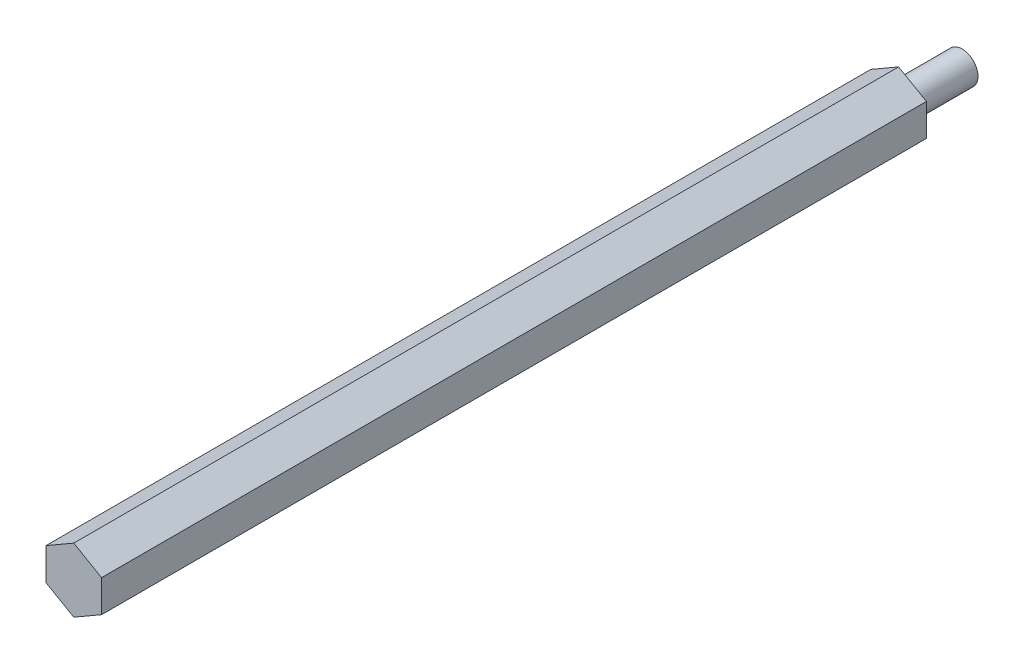
ISO-10303-21;
HEADER;
FILE_DESCRIPTION(('STEP AP214'),'2;1');
FILE_NAME('part.step','',(''),(''),'','','');
FILE_SCHEMA(('AUTOMOTIVE_DESIGN { 1 0 10303 214 1 1 1 1 }'));
ENDSEC;
DATA;
#1=APPLICATION_CONTEXT('core data for automotive mechanical design processes');
#2=APPLICATION_PROTOCOL_DEFINITION('international standard','automotive_design',2000,#1);
#3=PRODUCT_CONTEXT('',#1,'mechanical');
#4=PRODUCT('Part','Part','',(#3));
#5=PRODUCT_RELATED_PRODUCT_CATEGORY('part','',(#4));
#6=PRODUCT_DEFINITION_FORMATION('','',#4);
#7=PRODUCT_DEFINITION_CONTEXT('part definition',#1,'design');
#8=PRODUCT_DEFINITION('design','',#6,#7);
#9=PRODUCT_DEFINITION_SHAPE('','',#8);
#10=(LENGTH_UNIT() NAMED_UNIT(*) SI_UNIT(.MILLI.,.METRE.));
#11=(NAMED_UNIT(*) PLANE_ANGLE_UNIT() SI_UNIT($,.RADIAN.));
#12=(NAMED_UNIT(*) SI_UNIT($,.STERADIAN.) SOLID_ANGLE_UNIT());
#13=UNCERTAINTY_MEASURE_WITH_UNIT(LENGTH_MEASURE(1.E-05),#10,'distance_accuracy_value','');
#14=(GEOMETRIC_REPRESENTATION_CONTEXT(3) GLOBAL_UNCERTAINTY_ASSIGNED_CONTEXT((#13)) GLOBAL_UNIT_ASSIGNED_CONTEXT((#10,
#11,#12)) REPRESENTATION_CONTEXT('',''));
#15=CARTESIAN_POINT('',(0.,0.,0.));
#16=DIRECTION('',(0.,0.,1.));
#17=DIRECTION('',(1.,0.,0.));
#18=AXIS2_PLACEMENT_3D('',#15,#16,#17);
#19=CARTESIAN_POINT('',(-5.55625,3.20790243318486,82.5));
#20=DIRECTION('',(1.,0.,0.));
#21=DIRECTION('',(0.,1.,0.));
#22=AXIS2_PLACEMENT_3D('',#19,#20,#21);
#23=PLANE('',#22);
#24=DIRECTION('',(0.,0.,-1.));
#25=VECTOR('',#24,1.);
#26=CARTESIAN_POINT('',(-5.55625,3.20790243318486,82.5));
#27=LINE('',#26,#25);
#28=CARTESIAN_POINT('',(-5.55625,3.20790243318486,82.5));
#29=VERTEX_POINT('',#28);
#30=CARTESIAN_POINT('',(-5.55625,3.20790243318486,-82.5));
#31=VERTEX_POINT('',#30);
#32=EDGE_CURVE('E117',#29,#31,#27,.T.);
#33=ORIENTED_EDGE('',*,*,#32,.T.);
#34=DIRECTION('',(0.,-1.,0.));
#35=VECTOR('',#34,1.);
#36=CARTESIAN_POINT('',(-5.55625,3.20790243318486,-82.5));
#37=LINE('',#36,#35);
#38=CARTESIAN_POINT('',(-5.55625,-3.20790243318486,-82.5));
#39=VERTEX_POINT('',#38);
#40=EDGE_CURVE('E110',#31,#39,#37,.T.);
#41=ORIENTED_EDGE('',*,*,#40,.T.);
#42=DIRECTION('',(0.,0.,-1.));
#43=VECTOR('',#42,1.);
#44=CARTESIAN_POINT('',(-5.55625,-3.20790243318486,82.5));
#45=LINE('',#44,#43);
#46=CARTESIAN_POINT('',(-5.55625,-3.20790243318486,82.5));
#47=VERTEX_POINT('',#46);
#48=EDGE_CURVE('E11',#47,#39,#45,.T.);
#49=ORIENTED_EDGE('',*,*,#48,.F.);
#50=DIRECTION('',(0.,-1.,0.));
#51=VECTOR('',#50,1.);
#52=CARTESIAN_POINT('',(-5.55625,3.20790243318486,82.5));
#53=LINE('',#52,#51);
#54=EDGE_CURVE('E140',#29,#47,#53,.T.);
#55=ORIENTED_EDGE('',*,*,#54,.F.);
#56=EDGE_LOOP('',(#33,#41,#49,#55));
#57=FACE_BOUND('',#56,.T.);
#58=ADVANCED_FACE('F45',(#57),#23,.F.);
#59=CARTESIAN_POINT('',(-5.55625,-3.20790243318486,82.5));
#60=DIRECTION('',(0.5,0.866025403784439,0.));
#61=DIRECTION('',(-0.866025403784439,0.5,0.));
#62=AXIS2_PLACEMENT_3D('',#59,#60,#61);
#63=PLANE('',#62);
#64=ORIENTED_EDGE('',*,*,#48,.T.);
#65=DIRECTION('',(0.866025403784439,-0.5,0.));
#66=VECTOR('',#65,1.);
#67=CARTESIAN_POINT('',(-5.55625,-3.20790243318486,-82.5));
#68=LINE('',#67,#66);
#69=CARTESIAN_POINT('',(0.,-6.41580486636971,-82.5));
#70=VERTEX_POINT('',#69);
#71=EDGE_CURVE('E100',#39,#70,#68,.T.);
#72=ORIENTED_EDGE('',*,*,#71,.T.);
#73=DIRECTION('',(0.,0.,-1.));
#74=VECTOR('',#73,1.);
#75=CARTESIAN_POINT('',(0.,-6.41580486636971,82.5));
#76=LINE('',#75,#74);
#77=CARTESIAN_POINT('',(0.,-6.41580486636971,82.5));
#78=VERTEX_POINT('',#77);
#79=EDGE_CURVE('E53',#78,#70,#76,.T.);
#80=ORIENTED_EDGE('',*,*,#79,.F.);
#81=DIRECTION('',(0.866025403784439,-0.5,0.));
#82=VECTOR('',#81,1.);
#83=CARTESIAN_POINT('',(-5.55625,-3.20790243318486,82.5));
#84=LINE('',#83,#82);
#85=EDGE_CURVE('E101',#47,#78,#84,.T.);
#86=ORIENTED_EDGE('',*,*,#85,.F.);
#87=EDGE_LOOP('',(#64,#72,#80,#86));
#88=FACE_BOUND('',#87,.T.);
#89=ADVANCED_FACE('F98',(#88),#63,.F.);
#90=CARTESIAN_POINT('',(0.,-6.41580486636971,82.5));
#91=DIRECTION('',(-0.5,0.866025403784439,0.));
#92=DIRECTION('',(-0.866025403784439,-0.5,0.));
#93=AXIS2_PLACEMENT_3D('',#90,#91,#92);
#94=PLANE('',#93);
#95=ORIENTED_EDGE('',*,*,#79,.T.);
#96=DIRECTION('',(0.866025403784439,0.5,0.));
#97=VECTOR('',#96,1.);
#98=CARTESIAN_POINT('',(0.,-6.41580486636971,-82.5));
#99=LINE('',#98,#97);
#100=CARTESIAN_POINT('',(5.55625,-3.20790243318486,-82.5));
#101=VERTEX_POINT('',#100);
#102=EDGE_CURVE('E114',#70,#101,#99,.T.);
#103=ORIENTED_EDGE('',*,*,#102,.T.);
#104=DIRECTION('',(0.,0.,-1.));
#105=VECTOR('',#104,1.);
#106=CARTESIAN_POINT('',(5.55625,-3.20790243318486,82.5));
#107=LINE('',#106,#105);
#108=CARTESIAN_POINT('',(5.55625,-3.20790243318486,82.5));
#109=VERTEX_POINT('',#108);
#110=EDGE_CURVE('E163',#109,#101,#107,.T.);
#111=ORIENTED_EDGE('',*,*,#110,.F.);
#112=DIRECTION('',(0.866025403784439,0.5,0.));
#113=VECTOR('',#112,1.);
#114=CARTESIAN_POINT('',(0.,-6.41580486636971,82.5));
#115=LINE('',#114,#113);
#116=EDGE_CURVE('E145',#78,#109,#115,.T.);
#117=ORIENTED_EDGE('',*,*,#116,.F.);
#118=EDGE_LOOP('',(#95,#103,#111,#117));
#119=FACE_BOUND('',#118,.T.);
#120=ADVANCED_FACE('F168',(#119),#94,.F.);
#121=CARTESIAN_POINT('',(5.55625,-3.20790243318486,82.5));
#122=DIRECTION('',(-1.,0.,0.));
#123=DIRECTION('',(0.,0.,1.));
#124=AXIS2_PLACEMENT_3D('',#121,#122,#123);
#125=PLANE('',#124);
#126=ORIENTED_EDGE('',*,*,#110,.T.);
#127=DIRECTION('',(0.,1.,0.));
#128=VECTOR('',#127,1.);
#129=CARTESIAN_POINT('',(5.55625,-3.20790243318486,-82.5));
#130=LINE('',#129,#128);
#131=CARTESIAN_POINT('',(5.55625,3.20790243318486,-82.5));
#132=VERTEX_POINT('',#131);
#133=EDGE_CURVE('E129',#101,#132,#130,.T.);
#134=ORIENTED_EDGE('',*,*,#133,.T.);
#135=DIRECTION('',(0.,0.,-1.));
#136=VECTOR('',#135,1.);
#137=CARTESIAN_POINT('',(5.55625,3.20790243318486,82.5));
#138=LINE('',#137,#136);
#139=CARTESIAN_POINT('',(5.55625,3.20790243318486,82.5));
#140=VERTEX_POINT('',#139);
#141=EDGE_CURVE('E160',#140,#132,#138,.T.);
#142=ORIENTED_EDGE('',*,*,#141,.F.);
#143=DIRECTION('',(0.,1.,0.));
#144=VECTOR('',#143,1.);
#145=CARTESIAN_POINT('',(5.55625,-3.20790243318486,82.5));
#146=LINE('',#145,#144);
#147=EDGE_CURVE('E148',#109,#140,#146,.T.);
#148=ORIENTED_EDGE('',*,*,#147,.F.);
#149=EDGE_LOOP('',(#126,#134,#142,#148));
#150=FACE_BOUND('',#149,.T.);
#151=ADVANCED_FACE('F174',(#150),#125,.F.);
#152=CARTESIAN_POINT('',(5.55625,3.20790243318486,82.5));
#153=DIRECTION('',(-0.5,-0.866025403784439,0.));
#154=DIRECTION('',(0.866025403784439,-0.5,0.));
#155=AXIS2_PLACEMENT_3D('',#152,#153,#154);
#156=PLANE('',#155);
#157=ORIENTED_EDGE('',*,*,#141,.T.);
#158=DIRECTION('',(-0.866025403784439,0.5,0.));
#159=VECTOR('',#158,1.);
#160=CARTESIAN_POINT('',(5.55625,3.20790243318486,-82.5));
#161=LINE('',#160,#159);
#162=CARTESIAN_POINT('',(0.,6.41580486636972,-82.5));
#163=VERTEX_POINT('',#162);
#164=EDGE_CURVE('E133',#132,#163,#161,.T.);
#165=ORIENTED_EDGE('',*,*,#164,.T.);
#166=DIRECTION('',(0.,0.,-1.));
#167=VECTOR('',#166,1.);
#168=CARTESIAN_POINT('',(0.,6.41580486636972,82.5));
#169=LINE('',#168,#167);
#170=CARTESIAN_POINT('',(0.,6.41580486636972,82.5));
#171=VERTEX_POINT('',#170);
#172=EDGE_CURVE('E157',#171,#163,#169,.T.);
#173=ORIENTED_EDGE('',*,*,#172,.F.);
#174=DIRECTION('',(-0.866025403784439,0.5,0.));
#175=VECTOR('',#174,1.);
#176=CARTESIAN_POINT('',(5.55625,3.20790243318486,82.5));
#177=LINE('',#176,#175);
#178=EDGE_CURVE('E65',#140,#171,#177,.T.);
#179=ORIENTED_EDGE('',*,*,#178,.F.);
#180=EDGE_LOOP('',(#157,#165,#173,#179));
#181=FACE_BOUND('',#180,.T.);
#182=ADVANCED_FACE('F177',(#181),#156,.F.);
#183=CARTESIAN_POINT('',(0.,6.41580486636972,82.5));
#184=DIRECTION('',(0.5,-0.866025403784439,0.));
#185=DIRECTION('',(0.866025403784439,0.5,0.));
#186=AXIS2_PLACEMENT_3D('',#183,#184,#185);
#187=PLANE('',#186);
#188=ORIENTED_EDGE('',*,*,#172,.T.);
#189=DIRECTION('',(-0.866025403784439,-0.5,0.));
#190=VECTOR('',#189,1.);
#191=CARTESIAN_POINT('',(0.,6.41580486636972,-82.5));
#192=LINE('',#191,#190);
#193=EDGE_CURVE('E137',#163,#31,#192,.T.);
#194=ORIENTED_EDGE('',*,*,#193,.T.);
#195=ORIENTED_EDGE('',*,*,#32,.F.);
#196=DIRECTION('',(-0.866025403784439,-0.5,0.));
#197=VECTOR('',#196,1.);
#198=CARTESIAN_POINT('',(0.,6.41580486636972,82.5));
#199=LINE('',#198,#197);
#200=EDGE_CURVE('E60',#171,#29,#199,.T.);
#201=ORIENTED_EDGE('',*,*,#200,.F.);
#202=EDGE_LOOP('',(#188,#194,#195,#201));
#203=FACE_BOUND('',#202,.T.);
#204=ADVANCED_FACE('F179',(#203),#187,.F.);
#205=CARTESIAN_POINT('',(0.,0.,82.5));
#206=DIRECTION('',(0.,0.,1.));
#207=DIRECTION('',(1.,0.,0.));
#208=AXIS2_PLACEMENT_3D('',#205,#206,#207);
#209=PLANE('',#208);
#210=ORIENTED_EDGE('',*,*,#54,.T.);
#211=ORIENTED_EDGE('',*,*,#85,.T.);
#212=ORIENTED_EDGE('',*,*,#116,.T.);
#213=ORIENTED_EDGE('',*,*,#147,.T.);
#214=ORIENTED_EDGE('',*,*,#178,.T.);
#215=ORIENTED_EDGE('',*,*,#200,.T.);
#216=EDGE_LOOP('',(#210,#211,#212,#213,#214,#215));
#217=FACE_BOUND('',#216,.T.);
#218=ADVANCED_FACE('F171',(#217),#209,.T.);
#219=CARTESIAN_POINT('',(0.,0.,-82.5));
#220=DIRECTION('',(0.,0.,1.));
#221=DIRECTION('',(1.,0.,0.));
#222=AXIS2_PLACEMENT_3D('',#219,#220,#221);
#223=PLANE('',#222);
#224=CARTESIAN_POINT('',(0.,0.,-82.5));
#225=DIRECTION('',(0.,0.,1.));
#226=DIRECTION('',(1.,0.,0.));
#227=AXIS2_PLACEMENT_3D('',#224,#225,#226);
#228=CIRCLE('',#227,3.175);
#229=CARTESIAN_POINT('',(3.175,0.,-82.5));
#230=VERTEX_POINT('',#229);
#231=EDGE_CURVE('E123',#230,#230,#228,.T.);
#232=ORIENTED_EDGE('',*,*,#231,.T.);
#233=EDGE_LOOP('',(#232));
#234=FACE_BOUND('',#233,.T.);
#235=ORIENTED_EDGE('',*,*,#40,.F.);
#236=ORIENTED_EDGE('',*,*,#193,.F.);
#237=ORIENTED_EDGE('',*,*,#164,.F.);
#238=ORIENTED_EDGE('',*,*,#133,.F.);
#239=ORIENTED_EDGE('',*,*,#102,.F.);
#240=ORIENTED_EDGE('',*,*,#71,.F.);
#241=EDGE_LOOP('',(#235,#236,#237,#238,#239,#240));
#242=FACE_BOUND('',#241,.T.);
#243=ADVANCED_FACE('F108',(#234,#242),#223,.F.);
#244=CARTESIAN_POINT('',(0.,0.,-95.2));
#245=DIRECTION('',(0.,0.,1.));
#246=DIRECTION('',(1.,0.,0.));
#247=AXIS2_PLACEMENT_3D('',#244,#245,#246);
#248=CYLINDRICAL_SURFACE('',#247,3.175);
#249=CARTESIAN_POINT('',(0.,0.,-95.2));
#250=DIRECTION('',(0.,0.,1.));
#251=DIRECTION('',(1.,0.,0.));
#252=AXIS2_PLACEMENT_3D('',#249,#250,#251);
#253=CIRCLE('',#252,3.175);
#254=CARTESIAN_POINT('',(3.175,0.,-95.2));
#255=VERTEX_POINT('',#254);
#256=EDGE_CURVE('E119',#255,#255,#253,.T.);
#257=ORIENTED_EDGE('',*,*,#256,.T.);
#258=EDGE_LOOP('',(#257));
#259=FACE_BOUND('',#258,.T.);
#260=ORIENTED_EDGE('',*,*,#231,.F.);
#261=EDGE_LOOP('',(#260));
#262=FACE_BOUND('',#261,.T.);
#263=ADVANCED_FACE('F227',(#259,#262),#248,.T.);
#264=CARTESIAN_POINT('',(0.,0.,-95.2));
#265=DIRECTION('',(0.,0.,1.));
#266=DIRECTION('',(1.,0.,0.));
#267=AXIS2_PLACEMENT_3D('',#264,#265,#266);
#268=PLANE('',#267);
#269=ORIENTED_EDGE('',*,*,#256,.F.);
#270=EDGE_LOOP('',(#269));
#271=FACE_BOUND('',#270,.T.);
#272=ADVANCED_FACE('F237',(#271),#268,.F.);
#273=CLOSED_SHELL('',(#58,#89,#120,#151,#182,#204,#218,#243,#263,#272));
#274=MANIFOLD_SOLID_BREP('B2',#273);
#275=ADVANCED_BREP_SHAPE_REPRESENTATION('',(#18,#274),#14);
#276=SHAPE_DEFINITION_REPRESENTATION(#9,#275);
ENDSEC;
END-ISO-10303-21;
